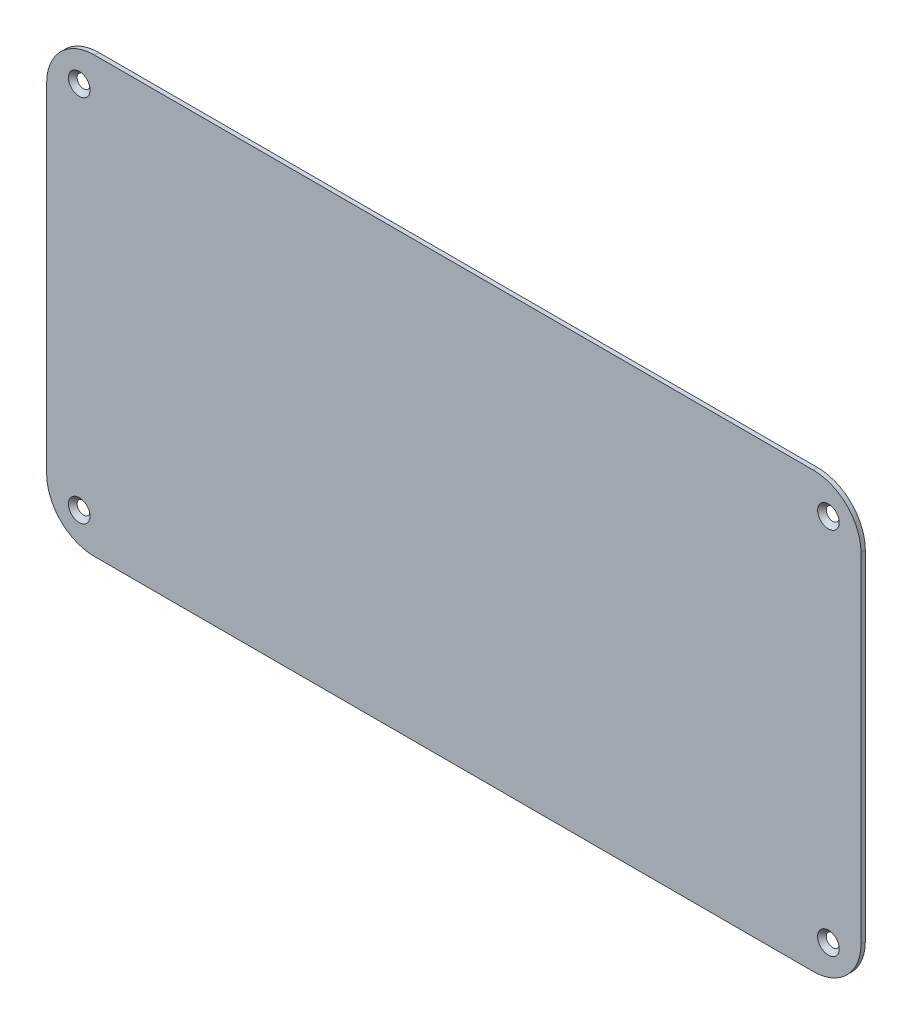
ISO-10303-21;
HEADER;
FILE_DESCRIPTION(('STEP AP214'),'2;1');
FILE_NAME('part.step','',(''),(''),'','','');
FILE_SCHEMA(('AUTOMOTIVE_DESIGN { 1 0 10303 214 1 1 1 1 }'));
ENDSEC;
DATA;
#1=APPLICATION_CONTEXT('core data for automotive mechanical design processes');
#2=APPLICATION_PROTOCOL_DEFINITION('international standard','automotive_design',2000,#1);
#3=PRODUCT_CONTEXT('',#1,'mechanical');
#4=PRODUCT('Part','Part','',(#3));
#5=PRODUCT_RELATED_PRODUCT_CATEGORY('part','',(#4));
#6=PRODUCT_DEFINITION_FORMATION('','',#4);
#7=PRODUCT_DEFINITION_CONTEXT('part definition',#1,'design');
#8=PRODUCT_DEFINITION('design','',#6,#7);
#9=PRODUCT_DEFINITION_SHAPE('','',#8);
#10=(LENGTH_UNIT() NAMED_UNIT(*) SI_UNIT(.MILLI.,.METRE.));
#11=(NAMED_UNIT(*) PLANE_ANGLE_UNIT() SI_UNIT($,.RADIAN.));
#12=(NAMED_UNIT(*) SI_UNIT($,.STERADIAN.) SOLID_ANGLE_UNIT());
#13=UNCERTAINTY_MEASURE_WITH_UNIT(LENGTH_MEASURE(1.E-05),#10,'distance_accuracy_value','');
#14=(GEOMETRIC_REPRESENTATION_CONTEXT(3) GLOBAL_UNCERTAINTY_ASSIGNED_CONTEXT((#13)) GLOBAL_UNIT_ASSIGNED_CONTEXT((#10,
#11,#12)) REPRESENTATION_CONTEXT('',''));
#15=CARTESIAN_POINT('',(0.,0.,0.));
#16=DIRECTION('',(0.,0.,1.));
#17=DIRECTION('',(1.,0.,0.));
#18=AXIS2_PLACEMENT_3D('',#15,#16,#17);
#19=CARTESIAN_POINT('',(165.5,-78.,0.));
#20=DIRECTION('',(0.,0.,1.));
#21=DIRECTION('',(1.,0.,0.));
#22=AXIS2_PLACEMENT_3D('',#19,#20,#21);
#23=PLANE('',#22);
#24=CARTESIAN_POINT('',(-172.5,85.,0.));
#25=DIRECTION('',(0.,0.,1.));
#26=DIRECTION('',(1.,0.,0.));
#27=AXIS2_PLACEMENT_3D('',#24,#25,#26);
#28=CIRCLE('',#27,2.98000000000001);
#29=CARTESIAN_POINT('',(-169.52,85.,0.));
#30=VERTEX_POINT('',#29);
#31=EDGE_CURVE('E235',#30,#30,#28,.T.);
#32=ORIENTED_EDGE('',*,*,#31,.T.);
#33=EDGE_LOOP('',(#32));
#34=FACE_BOUND('',#33,.T.);
#35=CARTESIAN_POINT('',(172.5,85.,0.));
#36=DIRECTION('',(0.,0.,1.));
#37=DIRECTION('',(1.,0.,0.));
#38=AXIS2_PLACEMENT_3D('',#35,#36,#37);
#39=CIRCLE('',#38,2.98000000000001);
#40=CARTESIAN_POINT('',(175.48,85.,0.));
#41=VERTEX_POINT('',#40);
#42=EDGE_CURVE('E39',#41,#41,#39,.T.);
#43=ORIENTED_EDGE('',*,*,#42,.T.);
#44=EDGE_LOOP('',(#43));
#45=FACE_BOUND('',#44,.T.);
#46=CARTESIAN_POINT('',(165.5,-78.,0.));
#47=DIRECTION('',(0.,0.,1.));
#48=DIRECTION('',(1.,0.,0.));
#49=AXIS2_PLACEMENT_3D('',#46,#47,#48);
#50=CIRCLE('',#49,22.);
#51=CARTESIAN_POINT('',(165.5,-100.,0.));
#52=VERTEX_POINT('',#51);
#53=CARTESIAN_POINT('',(187.5,-78.,0.));
#54=VERTEX_POINT('',#53);
#55=EDGE_CURVE('E134',#52,#54,#50,.T.);
#56=ORIENTED_EDGE('',*,*,#55,.F.);
#57=DIRECTION('',(1.,0.,0.));
#58=VECTOR('',#57,1.);
#59=CARTESIAN_POINT('',(-165.5,-100.,0.));
#60=LINE('',#59,#58);
#61=CARTESIAN_POINT('',(-165.5,-100.,0.));
#62=VERTEX_POINT('',#61);
#63=EDGE_CURVE('E89',#62,#52,#60,.T.);
#64=ORIENTED_EDGE('',*,*,#63,.F.);
#65=CARTESIAN_POINT('',(-165.5,-78.,0.));
#66=DIRECTION('',(0.,0.,1.));
#67=DIRECTION('',(-1.,0.,0.));
#68=AXIS2_PLACEMENT_3D('',#65,#66,#67);
#69=CIRCLE('',#68,22.);
#70=CARTESIAN_POINT('',(-187.5,-78.,0.));
#71=VERTEX_POINT('',#70);
#72=EDGE_CURVE('E83',#71,#62,#69,.T.);
#73=ORIENTED_EDGE('',*,*,#72,.F.);
#74=DIRECTION('',(0.,-1.,0.));
#75=VECTOR('',#74,1.);
#76=CARTESIAN_POINT('',(-187.5,78.,0.));
#77=LINE('',#76,#75);
#78=CARTESIAN_POINT('',(-187.5,78.,0.));
#79=VERTEX_POINT('',#78);
#80=EDGE_CURVE('E124',#79,#71,#77,.T.);
#81=ORIENTED_EDGE('',*,*,#80,.F.);
#82=CARTESIAN_POINT('',(-165.5,78.,0.));
#83=DIRECTION('',(0.,0.,1.));
#84=DIRECTION('',(-1.,0.,0.));
#85=AXIS2_PLACEMENT_3D('',#82,#83,#84);
#86=CIRCLE('',#85,22.);
#87=CARTESIAN_POINT('',(-165.5,100.,0.));
#88=VERTEX_POINT('',#87);
#89=EDGE_CURVE('E144',#88,#79,#86,.T.);
#90=ORIENTED_EDGE('',*,*,#89,.F.);
#91=DIRECTION('',(-1.,0.,0.));
#92=VECTOR('',#91,1.);
#93=CARTESIAN_POINT('',(-165.5,100.,0.));
#94=LINE('',#93,#92);
#95=CARTESIAN_POINT('',(165.5,100.,0.));
#96=VERTEX_POINT('',#95);
#97=EDGE_CURVE('E142',#96,#88,#94,.T.);
#98=ORIENTED_EDGE('',*,*,#97,.F.);
#99=CARTESIAN_POINT('',(165.5,78.,0.));
#100=DIRECTION('',(0.,0.,1.));
#101=DIRECTION('',(-1.,0.,0.));
#102=AXIS2_PLACEMENT_3D('',#99,#100,#101);
#103=CIRCLE('',#102,22.);
#104=CARTESIAN_POINT('',(187.5,78.,0.));
#105=VERTEX_POINT('',#104);
#106=EDGE_CURVE('E140',#105,#96,#103,.T.);
#107=ORIENTED_EDGE('',*,*,#106,.F.);
#108=DIRECTION('',(0.,1.,0.));
#109=VECTOR('',#108,1.);
#110=CARTESIAN_POINT('',(187.5,78.,0.));
#111=LINE('',#110,#109);
#112=EDGE_CURVE('E137',#54,#105,#111,.T.);
#113=ORIENTED_EDGE('',*,*,#112,.F.);
#114=EDGE_LOOP('',(#56,#64,#73,#81,#90,#98,#107,#113));
#115=FACE_BOUND('',#114,.T.);
#116=CARTESIAN_POINT('',(172.5,-85.,0.));
#117=DIRECTION('',(0.,0.,1.));
#118=DIRECTION('',(1.,0.,0.));
#119=AXIS2_PLACEMENT_3D('',#116,#117,#118);
#120=CIRCLE('',#119,2.98000000000001);
#121=CARTESIAN_POINT('',(175.48,-85.,0.));
#122=VERTEX_POINT('',#121);
#123=EDGE_CURVE('E138',#122,#122,#120,.T.);
#124=ORIENTED_EDGE('',*,*,#123,.T.);
#125=EDGE_LOOP('',(#124));
#126=FACE_BOUND('',#125,.T.);
#127=CARTESIAN_POINT('',(-172.5,-85.,0.));
#128=DIRECTION('',(0.,0.,1.));
#129=DIRECTION('',(1.,0.,0.));
#130=AXIS2_PLACEMENT_3D('',#127,#128,#129);
#131=CIRCLE('',#130,2.98000000000001);
#132=CARTESIAN_POINT('',(-169.52,-85.,0.));
#133=VERTEX_POINT('',#132);
#134=EDGE_CURVE('E239',#133,#133,#131,.T.);
#135=ORIENTED_EDGE('',*,*,#134,.T.);
#136=EDGE_LOOP('',(#135));
#137=FACE_BOUND('',#136,.T.);
#138=ADVANCED_FACE('F35',(#34,#45,#115,#126,#137),#23,.F.);
#139=CARTESIAN_POINT('',(165.5,-78.,2.));
#140=DIRECTION('',(0.,0.,-1.));
#141=DIRECTION('',(-1.,0.,0.));
#142=AXIS2_PLACEMENT_3D('',#139,#140,#141);
#143=CYLINDRICAL_SURFACE('',#142,22.);
#144=ORIENTED_EDGE('',*,*,#55,.T.);
#145=DIRECTION('',(0.,0.,-1.));
#146=VECTOR('',#145,1.);
#147=CARTESIAN_POINT('',(187.5,-78.,2.));
#148=LINE('',#147,#146);
#149=CARTESIAN_POINT('',(187.5,-78.,2.));
#150=VERTEX_POINT('',#149);
#151=EDGE_CURVE('E11',#150,#54,#148,.T.);
#152=ORIENTED_EDGE('',*,*,#151,.F.);
#153=CARTESIAN_POINT('',(165.5,-78.,2.));
#154=DIRECTION('',(0.,0.,1.));
#155=DIRECTION('',(1.,0.,0.));
#156=AXIS2_PLACEMENT_3D('',#153,#154,#155);
#157=CIRCLE('',#156,22.);
#158=CARTESIAN_POINT('',(165.5,-100.,2.));
#159=VERTEX_POINT('',#158);
#160=EDGE_CURVE('E149',#159,#150,#157,.T.);
#161=ORIENTED_EDGE('',*,*,#160,.F.);
#162=DIRECTION('',(0.,0.,-1.));
#163=VECTOR('',#162,1.);
#164=CARTESIAN_POINT('',(165.5,-100.,2.));
#165=LINE('',#164,#163);
#166=EDGE_CURVE('E130',#159,#52,#165,.T.);
#167=ORIENTED_EDGE('',*,*,#166,.T.);
#168=EDGE_LOOP('',(#144,#152,#161,#167));
#169=FACE_BOUND('',#168,.T.);
#170=ADVANCED_FACE('F37',(#169),#143,.T.);
#171=CARTESIAN_POINT('',(187.5,78.,2.));
#172=DIRECTION('',(-1.,0.,0.));
#173=DIRECTION('',(0.,-1.,0.));
#174=AXIS2_PLACEMENT_3D('',#171,#172,#173);
#175=PLANE('',#174);
#176=ORIENTED_EDGE('',*,*,#112,.T.);
#177=DIRECTION('',(0.,0.,-1.));
#178=VECTOR('',#177,1.);
#179=CARTESIAN_POINT('',(187.5,78.,2.));
#180=LINE('',#179,#178);
#181=CARTESIAN_POINT('',(187.5,78.,2.));
#182=VERTEX_POINT('',#181);
#183=EDGE_CURVE('E45',#182,#105,#180,.T.);
#184=ORIENTED_EDGE('',*,*,#183,.F.);
#185=DIRECTION('',(0.,1.,0.));
#186=VECTOR('',#185,1.);
#187=CARTESIAN_POINT('',(187.5,78.,2.));
#188=LINE('',#187,#186);
#189=EDGE_CURVE('E97',#150,#182,#188,.T.);
#190=ORIENTED_EDGE('',*,*,#189,.F.);
#191=ORIENTED_EDGE('',*,*,#151,.T.);
#192=EDGE_LOOP('',(#176,#184,#190,#191));
#193=FACE_BOUND('',#192,.T.);
#194=ADVANCED_FACE('F211',(#193),#175,.F.);
#195=CARTESIAN_POINT('',(165.5,78.,2.));
#196=DIRECTION('',(0.,0.,-1.));
#197=DIRECTION('',(-1.,0.,0.));
#198=AXIS2_PLACEMENT_3D('',#195,#196,#197);
#199=CYLINDRICAL_SURFACE('',#198,22.);
#200=ORIENTED_EDGE('',*,*,#106,.T.);
#201=DIRECTION('',(0.,0.,-1.));
#202=VECTOR('',#201,1.);
#203=CARTESIAN_POINT('',(165.5,100.,2.));
#204=LINE('',#203,#202);
#205=CARTESIAN_POINT('',(165.5,100.,2.));
#206=VERTEX_POINT('',#205);
#207=EDGE_CURVE('E156',#206,#96,#204,.T.);
#208=ORIENTED_EDGE('',*,*,#207,.F.);
#209=CARTESIAN_POINT('',(165.5,78.,2.));
#210=DIRECTION('',(0.,0.,1.));
#211=DIRECTION('',(-1.,0.,0.));
#212=AXIS2_PLACEMENT_3D('',#209,#210,#211);
#213=CIRCLE('',#212,22.);
#214=EDGE_CURVE('E175',#182,#206,#213,.T.);
#215=ORIENTED_EDGE('',*,*,#214,.F.);
#216=ORIENTED_EDGE('',*,*,#183,.T.);
#217=EDGE_LOOP('',(#200,#208,#215,#216));
#218=FACE_BOUND('',#217,.T.);
#219=ADVANCED_FACE('F314',(#218),#199,.T.);
#220=CARTESIAN_POINT('',(-165.5,100.,2.));
#221=DIRECTION('',(0.,-1.,0.));
#222=DIRECTION('',(1.,0.,0.));
#223=AXIS2_PLACEMENT_3D('',#220,#221,#222);
#224=PLANE('',#223);
#225=ORIENTED_EDGE('',*,*,#97,.T.);
#226=DIRECTION('',(0.,0.,-1.));
#227=VECTOR('',#226,1.);
#228=CARTESIAN_POINT('',(-165.5,100.,2.));
#229=LINE('',#228,#227);
#230=CARTESIAN_POINT('',(-165.5,100.,2.));
#231=VERTEX_POINT('',#230);
#232=EDGE_CURVE('E153',#231,#88,#229,.T.);
#233=ORIENTED_EDGE('',*,*,#232,.F.);
#234=DIRECTION('',(-1.,0.,0.));
#235=VECTOR('',#234,1.);
#236=CARTESIAN_POINT('',(-165.5,100.,2.));
#237=LINE('',#236,#235);
#238=EDGE_CURVE('E177',#206,#231,#237,.T.);
#239=ORIENTED_EDGE('',*,*,#238,.F.);
#240=ORIENTED_EDGE('',*,*,#207,.T.);
#241=EDGE_LOOP('',(#225,#233,#239,#240));
#242=FACE_BOUND('',#241,.T.);
#243=ADVANCED_FACE('F183',(#242),#224,.F.);
#244=CARTESIAN_POINT('',(-165.5,78.,2.));
#245=DIRECTION('',(0.,0.,-1.));
#246=DIRECTION('',(-1.,0.,0.));
#247=AXIS2_PLACEMENT_3D('',#244,#245,#246);
#248=CYLINDRICAL_SURFACE('',#247,22.);
#249=ORIENTED_EDGE('',*,*,#89,.T.);
#250=DIRECTION('',(0.,0.,-1.));
#251=VECTOR('',#250,1.);
#252=CARTESIAN_POINT('',(-187.5,78.,2.));
#253=LINE('',#252,#251);
#254=CARTESIAN_POINT('',(-187.5,78.,2.));
#255=VERTEX_POINT('',#254);
#256=EDGE_CURVE('E125',#255,#79,#253,.T.);
#257=ORIENTED_EDGE('',*,*,#256,.F.);
#258=CARTESIAN_POINT('',(-165.5,78.,2.));
#259=DIRECTION('',(0.,0.,1.));
#260=DIRECTION('',(-1.,0.,0.));
#261=AXIS2_PLACEMENT_3D('',#258,#259,#260);
#262=CIRCLE('',#261,22.);
#263=EDGE_CURVE('E116',#231,#255,#262,.T.);
#264=ORIENTED_EDGE('',*,*,#263,.F.);
#265=ORIENTED_EDGE('',*,*,#232,.T.);
#266=EDGE_LOOP('',(#249,#257,#264,#265));
#267=FACE_BOUND('',#266,.T.);
#268=ADVANCED_FACE('F187',(#267),#248,.T.);
#269=CARTESIAN_POINT('',(-187.5,78.,2.));
#270=DIRECTION('',(1.,0.,0.));
#271=DIRECTION('',(0.,1.,0.));
#272=AXIS2_PLACEMENT_3D('',#269,#270,#271);
#273=PLANE('',#272);
#274=ORIENTED_EDGE('',*,*,#80,.T.);
#275=DIRECTION('',(0.,0.,-1.));
#276=VECTOR('',#275,1.);
#277=CARTESIAN_POINT('',(-187.5,-78.,2.));
#278=LINE('',#277,#276);
#279=CARTESIAN_POINT('',(-187.5,-78.,2.));
#280=VERTEX_POINT('',#279);
#281=EDGE_CURVE('E121',#280,#71,#278,.T.);
#282=ORIENTED_EDGE('',*,*,#281,.F.);
#283=DIRECTION('',(0.,-1.,0.));
#284=VECTOR('',#283,1.);
#285=CARTESIAN_POINT('',(-187.5,78.,2.));
#286=LINE('',#285,#284);
#287=EDGE_CURVE('E110',#255,#280,#286,.T.);
#288=ORIENTED_EDGE('',*,*,#287,.F.);
#289=ORIENTED_EDGE('',*,*,#256,.T.);
#290=EDGE_LOOP('',(#274,#282,#288,#289));
#291=FACE_BOUND('',#290,.T.);
#292=ADVANCED_FACE('F122',(#291),#273,.F.);
#293=CARTESIAN_POINT('',(-165.5,-78.,2.));
#294=DIRECTION('',(0.,0.,-1.));
#295=DIRECTION('',(-1.,0.,0.));
#296=AXIS2_PLACEMENT_3D('',#293,#294,#295);
#297=CYLINDRICAL_SURFACE('',#296,22.);
#298=ORIENTED_EDGE('',*,*,#72,.T.);
#299=DIRECTION('',(0.,0.,-1.));
#300=VECTOR('',#299,1.);
#301=CARTESIAN_POINT('',(-165.5,-100.,2.));
#302=LINE('',#301,#300);
#303=CARTESIAN_POINT('',(-165.5,-100.,2.));
#304=VERTEX_POINT('',#303);
#305=EDGE_CURVE('E126',#304,#62,#302,.T.);
#306=ORIENTED_EDGE('',*,*,#305,.F.);
#307=CARTESIAN_POINT('',(-165.5,-78.,2.));
#308=DIRECTION('',(0.,0.,1.));
#309=DIRECTION('',(-1.,0.,0.));
#310=AXIS2_PLACEMENT_3D('',#307,#308,#309);
#311=CIRCLE('',#310,22.);
#312=EDGE_CURVE('E114',#280,#304,#311,.T.);
#313=ORIENTED_EDGE('',*,*,#312,.F.);
#314=ORIENTED_EDGE('',*,*,#281,.T.);
#315=EDGE_LOOP('',(#298,#306,#313,#314));
#316=FACE_BOUND('',#315,.T.);
#317=ADVANCED_FACE('F128',(#316),#297,.T.);
#318=CARTESIAN_POINT('',(-165.5,-100.,2.));
#319=DIRECTION('',(0.,1.,0.));
#320=DIRECTION('',(0.,0.,1.));
#321=AXIS2_PLACEMENT_3D('',#318,#319,#320);
#322=PLANE('',#321);
#323=ORIENTED_EDGE('',*,*,#63,.T.);
#324=ORIENTED_EDGE('',*,*,#166,.F.);
#325=DIRECTION('',(1.,0.,0.));
#326=VECTOR('',#325,1.);
#327=CARTESIAN_POINT('',(-165.5,-100.,2.));
#328=LINE('',#327,#326);
#329=EDGE_CURVE('E54',#304,#159,#328,.T.);
#330=ORIENTED_EDGE('',*,*,#329,.F.);
#331=ORIENTED_EDGE('',*,*,#305,.T.);
#332=EDGE_LOOP('',(#323,#324,#330,#331));
#333=FACE_BOUND('',#332,.T.);
#334=ADVANCED_FACE('F194',(#333),#322,.F.);
#335=CARTESIAN_POINT('',(165.5,-78.,2.));
#336=DIRECTION('',(0.,0.,1.));
#337=DIRECTION('',(1.,0.,0.));
#338=AXIS2_PLACEMENT_3D('',#335,#336,#337);
#339=PLANE('',#338);
#340=CARTESIAN_POINT('',(-172.5,85.,2.));
#341=DIRECTION('',(0.,0.,1.));
#342=DIRECTION('',(1.,0.,0.));
#343=AXIS2_PLACEMENT_3D('',#340,#341,#342);
#344=CIRCLE('',#343,4.98000000000001);
#345=CARTESIAN_POINT('',(-167.52,85.,2.));
#346=VERTEX_POINT('',#345);
#347=EDGE_CURVE('E233',#346,#346,#344,.T.);
#348=ORIENTED_EDGE('',*,*,#347,.F.);
#349=EDGE_LOOP('',(#348));
#350=FACE_BOUND('',#349,.T.);
#351=CARTESIAN_POINT('',(-172.5,-85.,2.));
#352=DIRECTION('',(0.,0.,1.));
#353=DIRECTION('',(1.,0.,0.));
#354=AXIS2_PLACEMENT_3D('',#351,#352,#353);
#355=CIRCLE('',#354,4.98000000000001);
#356=CARTESIAN_POINT('',(-167.52,-85.,2.));
#357=VERTEX_POINT('',#356);
#358=EDGE_CURVE('E236',#357,#357,#355,.T.);
#359=ORIENTED_EDGE('',*,*,#358,.F.);
#360=EDGE_LOOP('',(#359));
#361=FACE_BOUND('',#360,.T.);
#362=CARTESIAN_POINT('',(172.5,85.,2.));
#363=DIRECTION('',(0.,0.,1.));
#364=DIRECTION('',(1.,0.,0.));
#365=AXIS2_PLACEMENT_3D('',#362,#363,#364);
#366=CIRCLE('',#365,4.98000000000001);
#367=CARTESIAN_POINT('',(177.48,85.,2.));
#368=VERTEX_POINT('',#367);
#369=EDGE_CURVE('E169',#368,#368,#366,.T.);
#370=ORIENTED_EDGE('',*,*,#369,.F.);
#371=EDGE_LOOP('',(#370));
#372=FACE_BOUND('',#371,.T.);
#373=CARTESIAN_POINT('',(172.5,-85.,2.));
#374=DIRECTION('',(0.,0.,1.));
#375=DIRECTION('',(1.,0.,0.));
#376=AXIS2_PLACEMENT_3D('',#373,#374,#375);
#377=CIRCLE('',#376,4.98000000000001);
#378=CARTESIAN_POINT('',(177.48,-85.,2.));
#379=VERTEX_POINT('',#378);
#380=EDGE_CURVE('E161',#379,#379,#377,.T.);
#381=ORIENTED_EDGE('',*,*,#380,.F.);
#382=EDGE_LOOP('',(#381));
#383=FACE_BOUND('',#382,.T.);
#384=ORIENTED_EDGE('',*,*,#160,.T.);
#385=ORIENTED_EDGE('',*,*,#189,.T.);
#386=ORIENTED_EDGE('',*,*,#214,.T.);
#387=ORIENTED_EDGE('',*,*,#238,.T.);
#388=ORIENTED_EDGE('',*,*,#263,.T.);
#389=ORIENTED_EDGE('',*,*,#287,.T.);
#390=ORIENTED_EDGE('',*,*,#312,.T.);
#391=ORIENTED_EDGE('',*,*,#329,.T.);
#392=EDGE_LOOP('',(#384,#385,#386,#387,#388,#389,#390,#391));
#393=FACE_BOUND('',#392,.T.);
#394=ADVANCED_FACE('F112',(#350,#361,#372,#383,#393),#339,.T.);
#395=CARTESIAN_POINT('',(172.5,-85.,2.));
#396=DIRECTION('',(0.,0.,1.));
#397=DIRECTION('',(1.,0.,0.));
#398=AXIS2_PLACEMENT_3D('',#395,#396,#397);
#399=CONICAL_SURFACE('',#398,4.98000000000001,0.785398163397448);
#400=ORIENTED_EDGE('',*,*,#380,.T.);
#401=EDGE_LOOP('',(#400));
#402=FACE_BOUND('',#401,.T.);
#403=ORIENTED_EDGE('',*,*,#123,.F.);
#404=EDGE_LOOP('',(#403));
#405=FACE_BOUND('',#404,.T.);
#406=ADVANCED_FACE('F201',(#402,#405),#399,.F.);
#407=CARTESIAN_POINT('',(172.5,85.,2.));
#408=DIRECTION('',(0.,0.,1.));
#409=DIRECTION('',(1.,0.,0.));
#410=AXIS2_PLACEMENT_3D('',#407,#408,#409);
#411=CONICAL_SURFACE('',#410,4.98000000000001,0.785398163397448);
#412=ORIENTED_EDGE('',*,*,#369,.T.);
#413=EDGE_LOOP('',(#412));
#414=FACE_BOUND('',#413,.T.);
#415=ORIENTED_EDGE('',*,*,#42,.F.);
#416=EDGE_LOOP('',(#415));
#417=FACE_BOUND('',#416,.T.);
#418=ADVANCED_FACE('F217',(#414,#417),#411,.F.);
#419=CARTESIAN_POINT('',(-172.5,-85.,2.));
#420=DIRECTION('',(0.,0.,1.));
#421=DIRECTION('',(1.,0.,0.));
#422=AXIS2_PLACEMENT_3D('',#419,#420,#421);
#423=CONICAL_SURFACE('',#422,4.98000000000001,0.785398163397448);
#424=ORIENTED_EDGE('',*,*,#358,.T.);
#425=EDGE_LOOP('',(#424));
#426=FACE_BOUND('',#425,.T.);
#427=ORIENTED_EDGE('',*,*,#134,.F.);
#428=EDGE_LOOP('',(#427));
#429=FACE_BOUND('',#428,.T.);
#430=ADVANCED_FACE('F220',(#426,#429),#423,.F.);
#431=CARTESIAN_POINT('',(-172.5,85.,2.));
#432=DIRECTION('',(0.,0.,1.));
#433=DIRECTION('',(1.,0.,0.));
#434=AXIS2_PLACEMENT_3D('',#431,#432,#433);
#435=CONICAL_SURFACE('',#434,4.98000000000001,0.785398163397448);
#436=ORIENTED_EDGE('',*,*,#347,.T.);
#437=EDGE_LOOP('',(#436));
#438=FACE_BOUND('',#437,.T.);
#439=ORIENTED_EDGE('',*,*,#31,.F.);
#440=EDGE_LOOP('',(#439));
#441=FACE_BOUND('',#440,.T.);
#442=ADVANCED_FACE('F224',(#438,#441),#435,.F.);
#443=CLOSED_SHELL('',(#138,#170,#194,#219,#243,#268,#292,#317,#334,#394,#406,#418,#430,#442));
#444=MANIFOLD_SOLID_BREP('B2',#443);
#445=ADVANCED_BREP_SHAPE_REPRESENTATION('',(#18,#444),#14);
#446=SHAPE_DEFINITION_REPRESENTATION(#9,#445);
ENDSEC;
END-ISO-10303-21;
